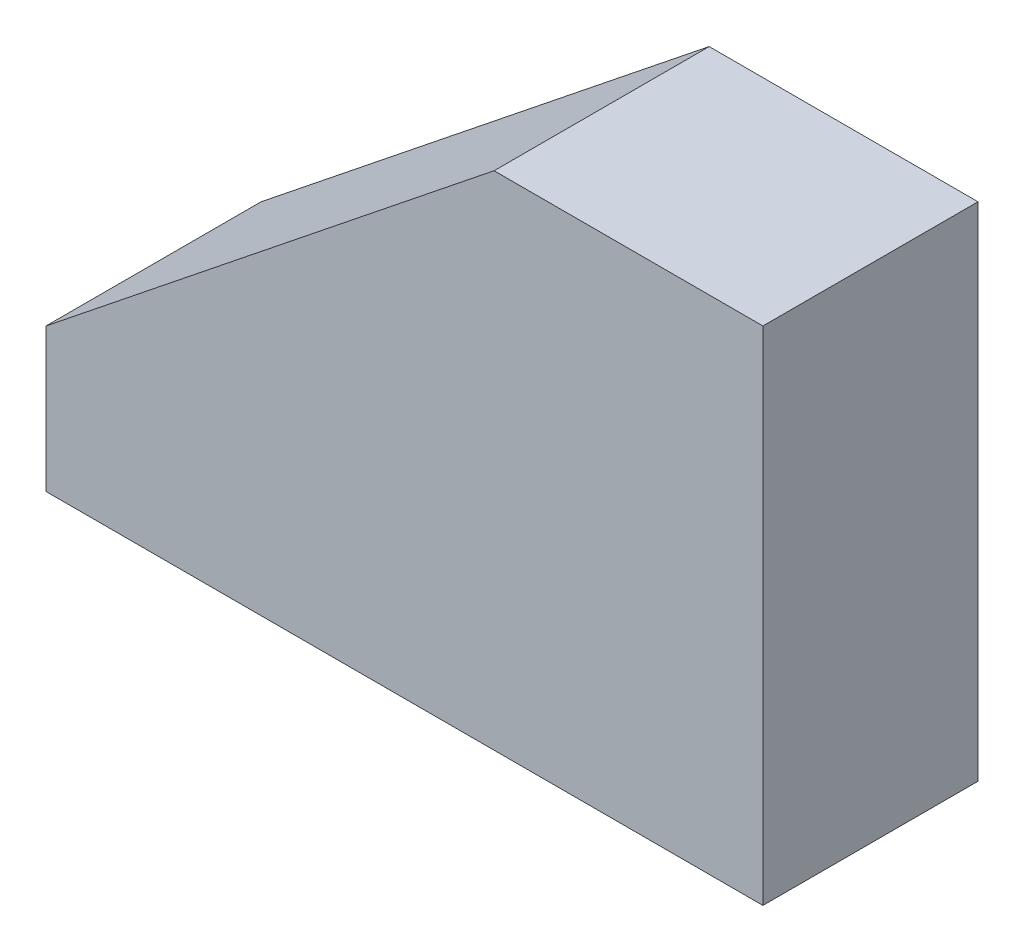
ISO-10303-21;
HEADER;
FILE_DESCRIPTION(('STEP AP214'),'2;1');
FILE_NAME('part.step','',(''),(''),'','','');
FILE_SCHEMA(('AUTOMOTIVE_DESIGN { 1 0 10303 214 1 1 1 1 }'));
ENDSEC;
DATA;
#1=APPLICATION_CONTEXT('core data for automotive mechanical design processes');
#2=APPLICATION_PROTOCOL_DEFINITION('international standard','automotive_design',2000,#1);
#3=PRODUCT_CONTEXT('',#1,'mechanical');
#4=PRODUCT('Part','Part','',(#3));
#5=PRODUCT_RELATED_PRODUCT_CATEGORY('part','',(#4));
#6=PRODUCT_DEFINITION_FORMATION('','',#4);
#7=PRODUCT_DEFINITION_CONTEXT('part definition',#1,'design');
#8=PRODUCT_DEFINITION('design','',#6,#7);
#9=PRODUCT_DEFINITION_SHAPE('','',#8);
#10=(LENGTH_UNIT() NAMED_UNIT(*) SI_UNIT(.MILLI.,.METRE.));
#11=(NAMED_UNIT(*) PLANE_ANGLE_UNIT() SI_UNIT($,.RADIAN.));
#12=(NAMED_UNIT(*) SI_UNIT($,.STERADIAN.) SOLID_ANGLE_UNIT());
#13=UNCERTAINTY_MEASURE_WITH_UNIT(LENGTH_MEASURE(1.E-05),#10,'distance_accuracy_value','');
#14=(GEOMETRIC_REPRESENTATION_CONTEXT(3) GLOBAL_UNCERTAINTY_ASSIGNED_CONTEXT((#13)) GLOBAL_UNIT_ASSIGNED_CONTEXT((#10,
#11,#12)) REPRESENTATION_CONTEXT('',''));
#15=CARTESIAN_POINT('',(0.,0.,0.));
#16=DIRECTION('',(0.,0.,1.));
#17=DIRECTION('',(1.,0.,0.));
#18=AXIS2_PLACEMENT_3D('',#15,#16,#17);
#19=CARTESIAN_POINT('',(-200.,40.,-548.262224629348));
#20=DIRECTION('',(-1.,0.,0.));
#21=DIRECTION('',(0.,0.,1.));
#22=AXIS2_PLACEMENT_3D('',#19,#20,#21);
#23=PLANE('',#22);
#24=DIRECTION('',(0.,1.,0.));
#25=VECTOR('',#24,1.);
#26=CARTESIAN_POINT('',(-200.,40.,-60.));
#27=LINE('',#26,#25);
#28=CARTESIAN_POINT('',(-200.,-40.,-60.));
#29=VERTEX_POINT('',#28);
#30=CARTESIAN_POINT('',(-200.,40.,-60.));
#31=VERTEX_POINT('',#30);
#32=EDGE_CURVE('E59',#29,#31,#27,.T.);
#33=ORIENTED_EDGE('',*,*,#32,.F.);
#34=DIRECTION('',(0.,0.,1.));
#35=VECTOR('',#34,1.);
#36=CARTESIAN_POINT('',(-200.,-40.,-548.262224629348));
#37=LINE('',#36,#35);
#38=CARTESIAN_POINT('',(-200.,-40.,60.));
#39=VERTEX_POINT('',#38);
#40=EDGE_CURVE('E92',#29,#39,#37,.T.);
#41=ORIENTED_EDGE('',*,*,#40,.T.);
#42=DIRECTION('',(0.,-1.,0.));
#43=VECTOR('',#42,1.);
#44=CARTESIAN_POINT('',(-200.,40.,60.));
#45=LINE('',#44,#43);
#46=CARTESIAN_POINT('',(-200.,40.,60.));
#47=VERTEX_POINT('',#46);
#48=EDGE_CURVE('E96',#47,#39,#45,.T.);
#49=ORIENTED_EDGE('',*,*,#48,.F.);
#50=DIRECTION('',(0.,0.,1.));
#51=VECTOR('',#50,1.);
#52=CARTESIAN_POINT('',(-200.,40.,-548.262224629348));
#53=LINE('',#52,#51);
#54=EDGE_CURVE('E123',#31,#47,#53,.T.);
#55=ORIENTED_EDGE('',*,*,#54,.F.);
#56=EDGE_LOOP('',(#33,#41,#49,#55));
#57=FACE_BOUND('',#56,.T.);
#58=ADVANCED_FACE('F51',(#57),#23,.T.);
#59=CARTESIAN_POINT('',(49.9999999999999,240.,-548.262224629348));
#60=DIRECTION('',(-0.624695047554424,0.78086880944303,0.));
#61=DIRECTION('',(-0.78086880944303,-0.624695047554424,0.));
#62=AXIS2_PLACEMENT_3D('',#59,#60,#61);
#63=PLANE('',#62);
#64=DIRECTION('',(0.78086880944303,0.624695047554424,0.));
#65=VECTOR('',#64,1.);
#66=CARTESIAN_POINT('',(49.9999999999999,240.,-60.));
#67=LINE('',#66,#65);
#68=CARTESIAN_POINT('',(49.9999999999999,240.,-60.));
#69=VERTEX_POINT('',#68);
#70=EDGE_CURVE('E140',#31,#69,#67,.T.);
#71=ORIENTED_EDGE('',*,*,#70,.F.);
#72=ORIENTED_EDGE('',*,*,#54,.T.);
#73=DIRECTION('',(-0.78086880944303,-0.624695047554424,0.));
#74=VECTOR('',#73,1.);
#75=CARTESIAN_POINT('',(49.9999999999999,240.,60.));
#76=LINE('',#75,#74);
#77=CARTESIAN_POINT('',(49.9999999999999,240.,60.));
#78=VERTEX_POINT('',#77);
#79=EDGE_CURVE('E102',#78,#47,#76,.T.);
#80=ORIENTED_EDGE('',*,*,#79,.F.);
#81=DIRECTION('',(0.,0.,1.));
#82=VECTOR('',#81,1.);
#83=CARTESIAN_POINT('',(49.9999999999999,240.,-548.262224629348));
#84=LINE('',#83,#82);
#85=EDGE_CURVE('E126',#69,#78,#84,.T.);
#86=ORIENTED_EDGE('',*,*,#85,.F.);
#87=EDGE_LOOP('',(#71,#72,#80,#86));
#88=FACE_BOUND('',#87,.T.);
#89=ADVANCED_FACE('F139',(#88),#63,.T.);
#90=CARTESIAN_POINT('',(200.,240.,-548.262224629348));
#91=DIRECTION('',(0.,1.,0.));
#92=DIRECTION('',(0.,0.,1.));
#93=AXIS2_PLACEMENT_3D('',#90,#91,#92);
#94=PLANE('',#93);
#95=DIRECTION('',(1.,0.,0.));
#96=VECTOR('',#95,1.);
#97=CARTESIAN_POINT('',(200.,240.,-60.));
#98=LINE('',#97,#96);
#99=CARTESIAN_POINT('',(200.,240.,-60.));
#100=VERTEX_POINT('',#99);
#101=EDGE_CURVE('E66',#69,#100,#98,.T.);
#102=ORIENTED_EDGE('',*,*,#101,.F.);
#103=ORIENTED_EDGE('',*,*,#85,.T.);
#104=DIRECTION('',(-1.,0.,0.));
#105=VECTOR('',#104,1.);
#106=CARTESIAN_POINT('',(200.,240.,60.));
#107=LINE('',#106,#105);
#108=CARTESIAN_POINT('',(200.,240.,60.));
#109=VERTEX_POINT('',#108);
#110=EDGE_CURVE('E120',#109,#78,#107,.T.);
#111=ORIENTED_EDGE('',*,*,#110,.F.);
#112=DIRECTION('',(0.,0.,1.));
#113=VECTOR('',#112,1.);
#114=CARTESIAN_POINT('',(200.,240.,-548.262224629348));
#115=LINE('',#114,#113);
#116=EDGE_CURVE('E128',#100,#109,#115,.T.);
#117=ORIENTED_EDGE('',*,*,#116,.F.);
#118=EDGE_LOOP('',(#102,#103,#111,#117));
#119=FACE_BOUND('',#118,.T.);
#120=ADVANCED_FACE('F135',(#119),#94,.T.);
#121=CARTESIAN_POINT('',(200.,-40.,-548.262224629348));
#122=DIRECTION('',(1.,0.,0.));
#123=DIRECTION('',(0.,1.,0.));
#124=AXIS2_PLACEMENT_3D('',#121,#122,#123);
#125=PLANE('',#124);
#126=DIRECTION('',(0.,-1.,0.));
#127=VECTOR('',#126,1.);
#128=CARTESIAN_POINT('',(200.,-40.,-60.));
#129=LINE('',#128,#127);
#130=CARTESIAN_POINT('',(200.,-40.,-60.));
#131=VERTEX_POINT('',#130);
#132=EDGE_CURVE('E125',#100,#131,#129,.T.);
#133=ORIENTED_EDGE('',*,*,#132,.F.);
#134=ORIENTED_EDGE('',*,*,#116,.T.);
#135=DIRECTION('',(0.,1.,0.));
#136=VECTOR('',#135,1.);
#137=CARTESIAN_POINT('',(200.,-40.,60.));
#138=LINE('',#137,#136);
#139=CARTESIAN_POINT('',(200.,-40.,60.));
#140=VERTEX_POINT('',#139);
#141=EDGE_CURVE('E110',#140,#109,#138,.T.);
#142=ORIENTED_EDGE('',*,*,#141,.F.);
#143=DIRECTION('',(0.,0.,1.));
#144=VECTOR('',#143,1.);
#145=CARTESIAN_POINT('',(200.,-40.,-548.262224629348));
#146=LINE('',#145,#144);
#147=EDGE_CURVE('E101',#131,#140,#146,.T.);
#148=ORIENTED_EDGE('',*,*,#147,.F.);
#149=EDGE_LOOP('',(#133,#134,#142,#148));
#150=FACE_BOUND('',#149,.T.);
#151=ADVANCED_FACE('F133',(#150),#125,.T.);
#152=CARTESIAN_POINT('',(-200.,-40.,-548.262224629348));
#153=DIRECTION('',(0.,-1.,0.));
#154=DIRECTION('',(0.,0.,-1.));
#155=AXIS2_PLACEMENT_3D('',#152,#153,#154);
#156=PLANE('',#155);
#157=DIRECTION('',(-1.,0.,0.));
#158=VECTOR('',#157,1.);
#159=CARTESIAN_POINT('',(-200.,-40.,-60.));
#160=LINE('',#159,#158);
#161=EDGE_CURVE('E12',#131,#29,#160,.T.);
#162=ORIENTED_EDGE('',*,*,#161,.F.);
#163=ORIENTED_EDGE('',*,*,#147,.T.);
#164=DIRECTION('',(1.,0.,0.));
#165=VECTOR('',#164,1.);
#166=CARTESIAN_POINT('',(-200.,-40.,60.));
#167=LINE('',#166,#165);
#168=EDGE_CURVE('E104',#39,#140,#167,.T.);
#169=ORIENTED_EDGE('',*,*,#168,.F.);
#170=ORIENTED_EDGE('',*,*,#40,.F.);
#171=EDGE_LOOP('',(#162,#163,#169,#170));
#172=FACE_BOUND('',#171,.T.);
#173=ADVANCED_FACE('F105',(#172),#156,.T.);
#174=CARTESIAN_POINT('',(0.,0.,60.));
#175=DIRECTION('',(0.,0.,1.));
#176=DIRECTION('',(1.,0.,0.));
#177=AXIS2_PLACEMENT_3D('',#174,#175,#176);
#178=PLANE('',#177);
#179=ORIENTED_EDGE('',*,*,#48,.T.);
#180=ORIENTED_EDGE('',*,*,#168,.T.);
#181=ORIENTED_EDGE('',*,*,#141,.T.);
#182=ORIENTED_EDGE('',*,*,#110,.T.);
#183=ORIENTED_EDGE('',*,*,#79,.T.);
#184=EDGE_LOOP('',(#179,#180,#181,#182,#183));
#185=FACE_BOUND('',#184,.T.);
#186=ADVANCED_FACE('F112',(#185),#178,.T.);
#187=CARTESIAN_POINT('',(-200.,40.,-60.));
#188=DIRECTION('',(0.,0.,1.));
#189=DIRECTION('',(1.,0.,0.));
#190=AXIS2_PLACEMENT_3D('',#187,#188,#189);
#191=PLANE('',#190);
#192=ORIENTED_EDGE('',*,*,#32,.T.);
#193=ORIENTED_EDGE('',*,*,#70,.T.);
#194=ORIENTED_EDGE('',*,*,#101,.T.);
#195=ORIENTED_EDGE('',*,*,#132,.T.);
#196=ORIENTED_EDGE('',*,*,#161,.T.);
#197=EDGE_LOOP('',(#192,#193,#194,#195,#196));
#198=FACE_BOUND('',#197,.T.);
#199=ADVANCED_FACE('F141',(#198),#191,.F.);
#200=CLOSED_SHELL('',(#58,#89,#120,#151,#173,#186,#199));
#201=MANIFOLD_SOLID_BREP('B2',#200);
#202=CARTESIAN_POINT('',(200.,40.,60.));
#203=DIRECTION('',(-1.,0.,0.));
#204=DIRECTION('',(0.,0.,1.));
#205=AXIS2_PLACEMENT_3D('',#202,#203,#204);
#206=PLANE('',#205);
#207=DIRECTION('',(0.,0.,-1.));
#208=VECTOR('',#207,1.);
#209=CARTESIAN_POINT('',(200.,-40.,60.));
#210=LINE('',#209,#208);
#211=CARTESIAN_POINT('',(200.,-40.,60.));
#212=VERTEX_POINT('',#211);
#213=CARTESIAN_POINT('',(200.,-40.,-60.));
#214=VERTEX_POINT('',#213);
#215=EDGE_CURVE('E266',#212,#214,#210,.T.);
#216=ORIENTED_EDGE('',*,*,#215,.T.);
#217=DIRECTION('',(0.,-1.,0.));
#218=VECTOR('',#217,1.);
#219=CARTESIAN_POINT('',(200.,40.,-60.));
#220=LINE('',#219,#218);
#221=CARTESIAN_POINT('',(200.,240.,-60.));
#222=VERTEX_POINT('',#221);
#223=EDGE_CURVE('E49',#222,#214,#220,.T.);
#224=ORIENTED_EDGE('',*,*,#223,.F.);
#225=DIRECTION('',(0.,0.,1.));
#226=VECTOR('',#225,1.);
#227=CARTESIAN_POINT('',(200.,240.,-507.213595499958));
#228=LINE('',#227,#226);
#229=CARTESIAN_POINT('',(200.,240.,60.));
#230=VERTEX_POINT('',#229);
#231=EDGE_CURVE('E268',#222,#230,#228,.T.);
#232=ORIENTED_EDGE('',*,*,#231,.T.);
#233=DIRECTION('',(0.,-1.,0.));
#234=VECTOR('',#233,1.);
#235=CARTESIAN_POINT('',(200.,40.,60.));
#236=LINE('',#235,#234);
#237=EDGE_CURVE('E256',#230,#212,#236,.T.);
#238=ORIENTED_EDGE('',*,*,#237,.T.);
#239=EDGE_LOOP('',(#216,#224,#232,#238));
#240=FACE_BOUND('',#239,.T.);
#241=ADVANCED_FACE('F215',(#240),#206,.F.);
#242=CARTESIAN_POINT('',(-200.,40.,-60.));
#243=DIRECTION('',(0.,0.,1.));
#244=DIRECTION('',(1.,0.,0.));
#245=AXIS2_PLACEMENT_3D('',#242,#243,#244);
#246=PLANE('',#245);
#247=DIRECTION('',(-1.,0.,0.));
#248=VECTOR('',#247,1.);
#249=CARTESIAN_POINT('',(-200.,-40.,-60.));
#250=LINE('',#249,#248);
#251=CARTESIAN_POINT('',(-200.,-40.,-60.));
#252=VERTEX_POINT('',#251);
#253=EDGE_CURVE('E272',#214,#252,#250,.T.);
#254=ORIENTED_EDGE('',*,*,#253,.T.);
#255=DIRECTION('',(0.,-1.,0.));
#256=VECTOR('',#255,1.);
#257=CARTESIAN_POINT('',(-200.,40.,-60.));
#258=LINE('',#257,#256);
#259=CARTESIAN_POINT('',(-200.,40.,-60.));
#260=VERTEX_POINT('',#259);
#261=EDGE_CURVE('E223',#260,#252,#258,.T.);
#262=ORIENTED_EDGE('',*,*,#261,.F.);
#263=DIRECTION('',(0.78086880944303,0.624695047554424,0.));
#264=VECTOR('',#263,1.);
#265=CARTESIAN_POINT('',(-200.,40.,-60.));
#266=LINE('',#265,#264);
#267=CARTESIAN_POINT('',(49.9999999999999,240.,-60.));
#268=VERTEX_POINT('',#267);
#269=EDGE_CURVE('E273',#260,#268,#266,.T.);
#270=ORIENTED_EDGE('',*,*,#269,.T.);
#271=DIRECTION('',(1.,0.,0.));
#272=VECTOR('',#271,1.);
#273=CARTESIAN_POINT('',(49.9999999999999,240.,-60.));
#274=LINE('',#273,#272);
#275=EDGE_CURVE('E277',#268,#222,#274,.T.);
#276=ORIENTED_EDGE('',*,*,#275,.T.);
#277=ORIENTED_EDGE('',*,*,#223,.T.);
#278=EDGE_LOOP('',(#254,#262,#270,#276,#277));
#279=FACE_BOUND('',#278,.T.);
#280=ADVANCED_FACE('F286',(#279),#246,.F.);
#281=CARTESIAN_POINT('',(-200.,40.,60.));
#282=DIRECTION('',(1.,0.,0.));
#283=DIRECTION('',(0.,0.,-1.));
#284=AXIS2_PLACEMENT_3D('',#281,#282,#283);
#285=PLANE('',#284);
#286=DIRECTION('',(0.,0.,1.));
#287=VECTOR('',#286,1.);
#288=CARTESIAN_POINT('',(-200.,-40.,60.));
#289=LINE('',#288,#287);
#290=CARTESIAN_POINT('',(-200.,-40.,60.));
#291=VERTEX_POINT('',#290);
#292=EDGE_CURVE('E246',#252,#291,#289,.T.);
#293=ORIENTED_EDGE('',*,*,#292,.T.);
#294=DIRECTION('',(0.,-1.,0.));
#295=VECTOR('',#294,1.);
#296=CARTESIAN_POINT('',(-200.,40.,60.));
#297=LINE('',#296,#295);
#298=CARTESIAN_POINT('',(-200.,40.,60.));
#299=VERTEX_POINT('',#298);
#300=EDGE_CURVE('E231',#299,#291,#297,.T.);
#301=ORIENTED_EDGE('',*,*,#300,.F.);
#302=DIRECTION('',(0.,0.,1.));
#303=VECTOR('',#302,1.);
#304=CARTESIAN_POINT('',(-200.,40.,60.));
#305=LINE('',#304,#303);
#306=EDGE_CURVE('E261',#260,#299,#305,.T.);
#307=ORIENTED_EDGE('',*,*,#306,.F.);
#308=ORIENTED_EDGE('',*,*,#261,.T.);
#309=EDGE_LOOP('',(#293,#301,#307,#308));
#310=FACE_BOUND('',#309,.T.);
#311=ADVANCED_FACE('F283',(#310),#285,.F.);
#312=CARTESIAN_POINT('',(-200.,40.,60.));
#313=DIRECTION('',(0.,0.,-1.));
#314=DIRECTION('',(-1.,0.,0.));
#315=AXIS2_PLACEMENT_3D('',#312,#313,#314);
#316=PLANE('',#315);
#317=DIRECTION('',(1.,0.,0.));
#318=VECTOR('',#317,1.);
#319=CARTESIAN_POINT('',(-200.,-40.,60.));
#320=LINE('',#319,#318);
#321=EDGE_CURVE('E251',#291,#212,#320,.T.);
#322=ORIENTED_EDGE('',*,*,#321,.T.);
#323=ORIENTED_EDGE('',*,*,#237,.F.);
#324=DIRECTION('',(-1.,0.,0.));
#325=VECTOR('',#324,1.);
#326=CARTESIAN_POINT('',(49.9999999999999,240.,60.));
#327=LINE('',#326,#325);
#328=CARTESIAN_POINT('',(49.9999999999999,240.,60.));
#329=VERTEX_POINT('',#328);
#330=EDGE_CURVE('E299',#230,#329,#327,.T.);
#331=ORIENTED_EDGE('',*,*,#330,.T.);
#332=DIRECTION('',(-0.78086880944303,-0.624695047554424,0.));
#333=VECTOR('',#332,1.);
#334=CARTESIAN_POINT('',(-200.,40.,60.));
#335=LINE('',#334,#333);
#336=EDGE_CURVE('E303',#329,#299,#335,.T.);
#337=ORIENTED_EDGE('',*,*,#336,.T.);
#338=ORIENTED_EDGE('',*,*,#300,.T.);
#339=EDGE_LOOP('',(#322,#323,#331,#337,#338));
#340=FACE_BOUND('',#339,.T.);
#341=ADVANCED_FACE('F253',(#340),#316,.F.);
#342=CARTESIAN_POINT('',(0.,-40.,0.));
#343=DIRECTION('',(0.,-1.,0.));
#344=DIRECTION('',(0.,0.,-1.));
#345=AXIS2_PLACEMENT_3D('',#342,#343,#344);
#346=PLANE('',#345);
#347=ORIENTED_EDGE('',*,*,#215,.F.);
#348=ORIENTED_EDGE('',*,*,#321,.F.);
#349=ORIENTED_EDGE('',*,*,#292,.F.);
#350=ORIENTED_EDGE('',*,*,#253,.F.);
#351=EDGE_LOOP('',(#347,#348,#349,#350));
#352=FACE_BOUND('',#351,.T.);
#353=ADVANCED_FACE('F271',(#352),#346,.T.);
#354=CARTESIAN_POINT('',(-200.,40.,-507.213595499958));
#355=DIRECTION('',(-0.624695047554424,0.78086880944303,0.));
#356=DIRECTION('',(-0.78086880944303,-0.624695047554424,0.));
#357=AXIS2_PLACEMENT_3D('',#354,#355,#356);
#358=PLANE('',#357);
#359=ORIENTED_EDGE('',*,*,#269,.F.);
#360=ORIENTED_EDGE('',*,*,#306,.T.);
#361=ORIENTED_EDGE('',*,*,#336,.F.);
#362=DIRECTION('',(0.,0.,1.));
#363=VECTOR('',#362,1.);
#364=CARTESIAN_POINT('',(49.9999999999999,240.,-507.213595499958));
#365=LINE('',#364,#363);
#366=EDGE_CURVE('E297',#268,#329,#365,.T.);
#367=ORIENTED_EDGE('',*,*,#366,.F.);
#368=EDGE_LOOP('',(#359,#360,#361,#367));
#369=FACE_BOUND('',#368,.T.);
#370=ADVANCED_FACE('F305',(#369),#358,.T.);
#371=CARTESIAN_POINT('',(49.9999999999999,240.,-507.213595499958));
#372=DIRECTION('',(0.,1.,0.));
#373=DIRECTION('',(0.,0.,1.));
#374=AXIS2_PLACEMENT_3D('',#371,#372,#373);
#375=PLANE('',#374);
#376=ORIENTED_EDGE('',*,*,#275,.F.);
#377=ORIENTED_EDGE('',*,*,#366,.T.);
#378=ORIENTED_EDGE('',*,*,#330,.F.);
#379=ORIENTED_EDGE('',*,*,#231,.F.);
#380=EDGE_LOOP('',(#376,#377,#378,#379));
#381=FACE_BOUND('',#380,.T.);
#382=ADVANCED_FACE('F298',(#381),#375,.T.);
#383=CLOSED_SHELL('',(#241,#280,#311,#341,#353,#370,#382));
#384=MANIFOLD_SOLID_BREP('B6',#383);
#385=ADVANCED_BREP_SHAPE_REPRESENTATION('',(#18,#201,#384),#14);
#386=SHAPE_DEFINITION_REPRESENTATION(#9,#385);
ENDSEC;
END-ISO-10303-21;
